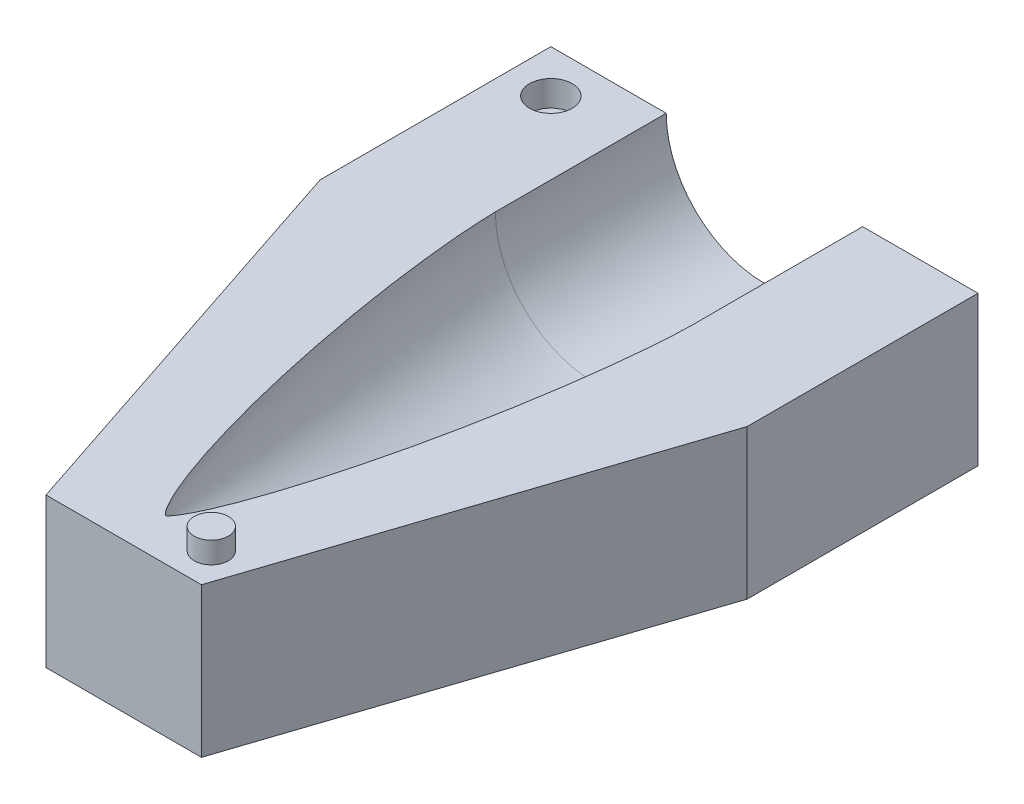
ISO-10303-21;
HEADER;
FILE_DESCRIPTION(('STEP AP214'),'2;1');
FILE_NAME('part.step','',(''),(''),'','','');
FILE_SCHEMA(('AUTOMOTIVE_DESIGN { 1 0 10303 214 1 1 1 1 }'));
ENDSEC;
DATA;
#1=APPLICATION_CONTEXT('core data for automotive mechanical design processes');
#2=APPLICATION_PROTOCOL_DEFINITION('international standard','automotive_design',2000,#1);
#3=PRODUCT_CONTEXT('',#1,'mechanical');
#4=PRODUCT('Part','Part','',(#3));
#5=PRODUCT_RELATED_PRODUCT_CATEGORY('part','',(#4));
#6=PRODUCT_DEFINITION_FORMATION('','',#4);
#7=PRODUCT_DEFINITION_CONTEXT('part definition',#1,'design');
#8=PRODUCT_DEFINITION('design','',#6,#7);
#9=PRODUCT_DEFINITION_SHAPE('','',#8);
#10=(LENGTH_UNIT() NAMED_UNIT(*) SI_UNIT(.MILLI.,.METRE.));
#11=(NAMED_UNIT(*) PLANE_ANGLE_UNIT() SI_UNIT($,.RADIAN.));
#12=(NAMED_UNIT(*) SI_UNIT($,.STERADIAN.) SOLID_ANGLE_UNIT());
#13=UNCERTAINTY_MEASURE_WITH_UNIT(LENGTH_MEASURE(1.E-05),#10,'distance_accuracy_value','');
#14=(GEOMETRIC_REPRESENTATION_CONTEXT(3) GLOBAL_UNCERTAINTY_ASSIGNED_CONTEXT((#13)) GLOBAL_UNIT_ASSIGNED_CONTEXT((#10,
#11,#12)) REPRESENTATION_CONTEXT('',''));
#15=CARTESIAN_POINT('',(0.,0.,0.));
#16=DIRECTION('',(0.,0.,1.));
#17=DIRECTION('',(1.,0.,0.));
#18=AXIS2_PLACEMENT_3D('',#15,#16,#17);
#19=CARTESIAN_POINT('',(0.,0.,0.));
#20=DIRECTION('',(0.,1.,0.));
#21=DIRECTION('',(0.,0.,1.));
#22=AXIS2_PLACEMENT_3D('',#19,#20,#21);
#23=PLANE('',#22);
#24=CARTESIAN_POINT('',(-40.,0.,-130.177152604319));
#25=DIRECTION('',(0.,1.,0.));
#26=DIRECTION('',(0.,0.,1.));
#27=AXIS2_PLACEMENT_3D('',#24,#25,#26);
#28=CIRCLE('',#27,5.);
#29=CARTESIAN_POINT('',(-40.,0.,-125.177152604319));
#30=VERTEX_POINT('',#29);
#31=EDGE_CURVE('E203',#30,#30,#28,.T.);
#32=ORIENTED_EDGE('',*,*,#31,.F.);
#33=EDGE_LOOP('',(#32));
#34=FACE_BOUND('',#33,.T.);
#35=CARTESIAN_POINT('',(12.5,0.,1.8228473956807));
#36=DIRECTION('',(0.,1.,0.));
#37=DIRECTION('',(0.,0.,1.));
#38=AXIS2_PLACEMENT_3D('',#35,#36,#37);
#39=CIRCLE('',#38,3.99999999999999);
#40=CARTESIAN_POINT('',(12.5,0.,5.82284739568069));
#41=VERTEX_POINT('',#40);
#42=EDGE_CURVE('E202',#41,#41,#39,.T.);
#43=ORIENTED_EDGE('',*,*,#42,.F.);
#44=EDGE_LOOP('',(#43));
#45=FACE_BOUND('',#44,.T.);
#46=DIRECTION('',(-0.31461271111549,0.,-0.949220123050792));
#47=VECTOR('',#46,1.);
#48=CARTESIAN_POINT('',(-50.,0.,-86.1379769190762));
#49=LINE('',#48,#47);
#50=CARTESIAN_POINT('',(-18.1944215410112,0.,9.8228473956807));
#51=VERTEX_POINT('',#50);
#52=CARTESIAN_POINT('',(-50.,0.,-86.1379769190762));
#53=VERTEX_POINT('',#52);
#54=EDGE_CURVE('E53',#51,#53,#49,.T.);
#55=ORIENTED_EDGE('',*,*,#54,.F.);
#56=DIRECTION('',(1.,0.,0.));
#57=VECTOR('',#56,1.);
#58=CARTESIAN_POINT('',(50.,0.,9.82284739568071));
#59=LINE('',#58,#57);
#60=CARTESIAN_POINT('',(18.1944215410112,0.,9.82284739568071));
#61=VERTEX_POINT('',#60);
#62=EDGE_CURVE('E221',#51,#61,#59,.T.);
#63=ORIENTED_EDGE('',*,*,#62,.T.);
#64=DIRECTION('',(-0.31461271111549,0.,0.949220123050792));
#65=VECTOR('',#64,1.);
#66=CARTESIAN_POINT('',(50.,0.,-86.1379769190762));
#67=LINE('',#66,#65);
#68=CARTESIAN_POINT('',(50.,0.,-86.1379769190762));
#69=VERTEX_POINT('',#68);
#70=EDGE_CURVE('E106',#69,#61,#67,.T.);
#71=ORIENTED_EDGE('',*,*,#70,.F.);
#72=DIRECTION('',(0.,0.,-1.));
#73=VECTOR('',#72,1.);
#74=CARTESIAN_POINT('',(50.,0.,0.));
#75=LINE('',#74,#73);
#76=CARTESIAN_POINT('',(50.,0.,-140.177152604319));
#77=VERTEX_POINT('',#76);
#78=EDGE_CURVE('E218',#69,#77,#75,.T.);
#79=ORIENTED_EDGE('',*,*,#78,.T.);
#80=DIRECTION('',(-1.,0.,0.));
#81=VECTOR('',#80,1.);
#82=CARTESIAN_POINT('',(50.,0.,-140.177152604319));
#83=LINE('',#82,#81);
#84=CARTESIAN_POINT('',(22.9913156668105,0.,-140.177152604319));
#85=VERTEX_POINT('',#84);
#86=EDGE_CURVE('E224',#77,#85,#83,.T.);
#87=ORIENTED_EDGE('',*,*,#86,.T.);
#88=DIRECTION('',(0.,0.,1.));
#89=VECTOR('',#88,1.);
#90=CARTESIAN_POINT('',(22.9913156668105,0.,0.));
#91=LINE('',#90,#89);
#92=CARTESIAN_POINT('',(22.9913156668105,0.,-100.177152604319));
#93=VERTEX_POINT('',#92);
#94=EDGE_CURVE('E231',#93,#85,#91,.F.);
#95=ORIENTED_EDGE('',*,*,#94,.F.);
#96=CARTESIAN_POINT('',(22.9913156668105,0.,-100.177152604319));
#97=CARTESIAN_POINT('',(22.9913156668105,0.,-99.6773830837032));
#98=CARTESIAN_POINT('',(22.9714099908985,0.,-98.6779967487854));
#99=CARTESIAN_POINT('',(22.875635683383,0.,-96.058091381564));
#100=CARTESIAN_POINT('',(22.6037020160242,0.,-91.8227807600398));
#101=CARTESIAN_POINT('',(22.1286848305687,0.,-86.4776261404894));
#102=CARTESIAN_POINT('',(21.3981607536077,0.,-80.0304974375297));
#103=CARTESIAN_POINT('',(20.5386098353281,0.,-73.5994887283923));
#104=CARTESIAN_POINT('',(19.563313868504,0.,-67.1850290563144));
#105=CARTESIAN_POINT('',(18.4805873670043,0.,-60.7878898986517));
#106=CARTESIAN_POINT('',(17.2939613531271,0.,-54.4091903934157));
#107=CARTESIAN_POINT('',(16.0041295859224,0.,-48.050573204807));
#108=CARTESIAN_POINT('',(14.608588480337,0.,-41.7142661554974));
#109=CARTESIAN_POINT('',(13.1014603152078,0.,-35.4035516128153));
#110=CARTESIAN_POINT('',(11.4726463716587,0.,-29.1230056500835));
#111=CARTESIAN_POINT('',(9.70512739419416,0.,-22.8799735817056));
#112=CARTESIAN_POINT('',(7.81425914639031,0.,-16.8230635383473));
#113=CARTESIAN_POINT('',(5.98538683150435,0.,-11.5994318892449));
#114=CARTESIAN_POINT('',(4.31706153991178,0.,-7.40332814922314));
#115=CARTESIAN_POINT('',(2.96045388006277,0.,-4.44576491835928));
#116=CARTESIAN_POINT('',(2.03469009013861,0.,-2.67850290129982));
#117=CARTESIAN_POINT('',(1.35492318038811,0.,-1.55273765823771));
#118=CARTESIAN_POINT('',(0.902060291211029,0.,-0.901337008533642));
#119=CARTESIAN_POINT('',(0.601235581178347,0.,-0.524430354454517));
#120=CARTESIAN_POINT('',(0.401983994044902,0.,-0.306591117086136));
#121=CARTESIAN_POINT('',(0.271568578547477,0.,-0.181890949137895));
#122=CARTESIAN_POINT('',(0.18355763089567,0.,-0.108056169269483));
#123=CARTESIAN_POINT('',(0.121023529313261,0.,-0.0618261369939828));
#124=CARTESIAN_POINT('',(0.0725878926251186,0.,-0.0309109385181754));
#125=CARTESIAN_POINT('',(0.0363511615834242,0.,-0.0111976924309942));
#126=CARTESIAN_POINT('',(0.0123794988745162,0.,-0.00300104938316236));
#127=CARTESIAN_POINT('',(0.,0.,0.));
#128=B_SPLINE_CURVE_WITH_KNOTS('',4,(#96,#97,#98,#99,#100,#101,#102,#103,#104,#105,#106,#107,
#108,#109,#110,#111,#112,#113,#114,#115,#116,#117,#118,#119,#120,#121,#122,#123,#124,#125,#126,
#127),.UNSPECIFIED.,.F.,.F.,(5,1,1,1,1,1,1,1,1,1,1,1,1,1,1,1,1,1,1,1,1,1,1,1,1,1,1,1,5),(0.,
0.0192882576807905,0.038576515361581,0.101176729872675,0.163776945029332,0.226377163001962,
0.28897737378094,0.351577593164917,0.41417780461237,0.476778019122959,0.539378235463863,
0.601978443197806,0.664578657112351,0.727178867221817,0.789779094894328,0.852379287962573,
0.909435495456412,0.940735609346367,0.963989150052229,0.977912976551439,0.986394042544016,
0.991459623657023,0.994588016567133,0.99651192245248,0.997780202195846,0.998418212786685,
0.999020025882964,0.999510012941482,1.),.UNSPECIFIED.);
#129=CARTESIAN_POINT('',(0.,0.,0.));
#130=VERTEX_POINT('',#129);
#131=EDGE_CURVE('E38',#130,#93,#128,.F.);
#132=ORIENTED_EDGE('',*,*,#131,.F.);
#133=CARTESIAN_POINT('',(-22.9913156668105,0.,-100.177152604319));
#134=CARTESIAN_POINT('',(-22.9913156668105,0.,-99.6773830837032));
#135=CARTESIAN_POINT('',(-22.9714099908985,0.,-98.6779967487854));
#136=CARTESIAN_POINT('',(-22.875635683383,0.,-96.058091381564));
#137=CARTESIAN_POINT('',(-22.6037020160242,0.,-91.8227807600398));
#138=CARTESIAN_POINT('',(-22.1286848305687,0.,-86.4776261404894));
#139=CARTESIAN_POINT('',(-21.3981607536077,0.,-80.0304974375297));
#140=CARTESIAN_POINT('',(-20.5386098353281,0.,-73.5994887283923));
#141=CARTESIAN_POINT('',(-19.563313868504,0.,-67.1850290563144));
#142=CARTESIAN_POINT('',(-18.4805873670043,0.,-60.7878898986517));
#143=CARTESIAN_POINT('',(-17.2939613531271,0.,-54.4091903934157));
#144=CARTESIAN_POINT('',(-16.0041295859224,0.,-48.050573204807));
#145=CARTESIAN_POINT('',(-14.608588480337,0.,-41.7142661554974));
#146=CARTESIAN_POINT('',(-13.1014603152078,0.,-35.4035516128153));
#147=CARTESIAN_POINT('',(-11.4726463716587,0.,-29.1230056500835));
#148=CARTESIAN_POINT('',(-9.70512739419416,0.,-22.8799735817056));
#149=CARTESIAN_POINT('',(-7.81425914639031,0.,-16.8230635383473));
#150=CARTESIAN_POINT('',(-5.98538683150435,0.,-11.5994318892449));
#151=CARTESIAN_POINT('',(-4.31706153991178,0.,-7.40332814922314));
#152=CARTESIAN_POINT('',(-2.96045388006277,0.,-4.44576491835928));
#153=CARTESIAN_POINT('',(-2.03469009013861,0.,-2.67850290129982));
#154=CARTESIAN_POINT('',(-1.35492318038811,0.,-1.55273765823771));
#155=CARTESIAN_POINT('',(-0.902060291211029,0.,-0.901337008533642));
#156=CARTESIAN_POINT('',(-0.601235581178347,0.,-0.524430354454517));
#157=CARTESIAN_POINT('',(-0.401983994044902,0.,-0.306591117086136));
#158=CARTESIAN_POINT('',(-0.271568578547477,0.,-0.181890949137895));
#159=CARTESIAN_POINT('',(-0.18355763089567,0.,-0.108056169269483));
#160=CARTESIAN_POINT('',(-0.121023529313261,0.,-0.0618261369939828));
#161=CARTESIAN_POINT('',(-0.0725878926251186,0.,-0.0309109385181754));
#162=CARTESIAN_POINT('',(-0.0363511615834242,0.,-0.0111976924309942));
#163=CARTESIAN_POINT('',(-0.0123794988745162,0.,-0.00300104938316236));
#164=CARTESIAN_POINT('',(0.,0.,0.));
#165=B_SPLINE_CURVE_WITH_KNOTS('',4,(#133,#134,#135,#136,#137,#138,#139,#140,#141,#142,#143,
#144,#145,#146,#147,#148,#149,#150,#151,#152,#153,#154,#155,#156,#157,#158,#159,#160,#161,#162,
#163,#164),.UNSPECIFIED.,.F.,.F.,(5,1,1,1,1,1,1,1,1,1,1,1,1,1,1,1,1,1,1,1,1,1,1,1,1,1,1,1,5),
(0.,0.0192882576807905,0.038576515361581,0.101176729872675,0.163776945029332,0.226377163001962,
0.28897737378094,0.351577593164917,0.41417780461237,0.476778019122959,0.539378235463863,
0.601978443197806,0.664578657112351,0.727178867221817,0.789779094894328,0.852379287962573,
0.909435495456412,0.940735609346367,0.963989150052229,0.977912976551439,0.986394042544016,
0.991459623657023,0.994588016567133,0.99651192245248,0.997780202195846,0.998418212786685,
0.999020025882964,0.999510012941482,1.),.UNSPECIFIED.);
#166=CARTESIAN_POINT('',(-22.9913156668105,0.,-100.177152604319));
#167=VERTEX_POINT('',#166);
#168=EDGE_CURVE('E131',#167,#130,#165,.T.);
#169=ORIENTED_EDGE('',*,*,#168,.F.);
#170=DIRECTION('',(0.,0.,1.));
#171=VECTOR('',#170,1.);
#172=CARTESIAN_POINT('',(-22.9913156668105,0.,0.));
#173=LINE('',#172,#171);
#174=CARTESIAN_POINT('',(-22.9913156668105,0.,-140.177152604319));
#175=VERTEX_POINT('',#174);
#176=EDGE_CURVE('E228',#175,#167,#173,.T.);
#177=ORIENTED_EDGE('',*,*,#176,.F.);
#178=CARTESIAN_POINT('',(-50.,0.,-140.177152604319));
#179=VERTEX_POINT('',#178);
#180=EDGE_CURVE('E148',#175,#179,#83,.T.);
#181=ORIENTED_EDGE('',*,*,#180,.T.);
#182=DIRECTION('',(0.,0.,-1.));
#183=VECTOR('',#182,1.);
#184=CARTESIAN_POINT('',(-50.,0.,0.));
#185=LINE('',#184,#183);
#186=EDGE_CURVE('E223',#53,#179,#185,.T.);
#187=ORIENTED_EDGE('',*,*,#186,.F.);
#188=EDGE_LOOP('',(#55,#63,#71,#79,#87,#95,#132,#169,#177,#181,#187));
#189=FACE_BOUND('',#188,.T.);
#190=ADVANCED_FACE('F35',(#34,#45,#189),#23,.T.);
#191=CARTESIAN_POINT('',(50.,-35.,-140.177152604319));
#192=DIRECTION('',(0.,1.,0.));
#193=DIRECTION('',(0.,0.,1.));
#194=AXIS2_PLACEMENT_3D('',#191,#192,#193);
#195=PLANE('',#194);
#196=DIRECTION('',(-1.,0.,0.));
#197=VECTOR('',#196,1.);
#198=CARTESIAN_POINT('',(50.,-35.,9.82284739568071));
#199=LINE('',#198,#197);
#200=CARTESIAN_POINT('',(18.1944215410112,-35.,9.82284739568071));
#201=VERTEX_POINT('',#200);
#202=CARTESIAN_POINT('',(-18.1944215410112,-35.,9.8228473956807));
#203=VERTEX_POINT('',#202);
#204=EDGE_CURVE('E119',#201,#203,#199,.T.);
#205=ORIENTED_EDGE('',*,*,#204,.T.);
#206=DIRECTION('',(-0.31461271111549,0.,-0.949220123050792));
#207=VECTOR('',#206,1.);
#208=CARTESIAN_POINT('',(-50.,-35.,-86.1379769190762));
#209=LINE('',#208,#207);
#210=CARTESIAN_POINT('',(-50.,-35.,-86.1379769190762));
#211=VERTEX_POINT('',#210);
#212=EDGE_CURVE('E122',#203,#211,#209,.T.);
#213=ORIENTED_EDGE('',*,*,#212,.T.);
#214=DIRECTION('',(0.,0.,-1.));
#215=VECTOR('',#214,1.);
#216=CARTESIAN_POINT('',(-50.,-35.,-140.177152604319));
#217=LINE('',#216,#215);
#218=CARTESIAN_POINT('',(-50.,-35.,-140.177152604319));
#219=VERTEX_POINT('',#218);
#220=EDGE_CURVE('E134',#211,#219,#217,.T.);
#221=ORIENTED_EDGE('',*,*,#220,.T.);
#222=DIRECTION('',(-1.,0.,0.));
#223=VECTOR('',#222,1.);
#224=CARTESIAN_POINT('',(50.,-35.,-140.177152604319));
#225=LINE('',#224,#223);
#226=CARTESIAN_POINT('',(50.,-35.,-140.177152604319));
#227=VERTEX_POINT('',#226);
#228=EDGE_CURVE('E126',#227,#219,#225,.T.);
#229=ORIENTED_EDGE('',*,*,#228,.F.);
#230=DIRECTION('',(0.,0.,-1.));
#231=VECTOR('',#230,1.);
#232=CARTESIAN_POINT('',(50.,-35.,-140.177152604319));
#233=LINE('',#232,#231);
#234=CARTESIAN_POINT('',(50.,-35.,-86.1379769190762));
#235=VERTEX_POINT('',#234);
#236=EDGE_CURVE('E121',#235,#227,#233,.T.);
#237=ORIENTED_EDGE('',*,*,#236,.F.);
#238=DIRECTION('',(-0.31461271111549,0.,0.949220123050792));
#239=VECTOR('',#238,1.);
#240=CARTESIAN_POINT('',(50.,-35.,-86.1379769190762));
#241=LINE('',#240,#239);
#242=EDGE_CURVE('E61',#235,#201,#241,.T.);
#243=ORIENTED_EDGE('',*,*,#242,.T.);
#244=EDGE_LOOP('',(#205,#213,#221,#229,#237,#243));
#245=FACE_BOUND('',#244,.T.);
#246=ADVANCED_FACE('F117',(#245),#195,.F.);
#247=CARTESIAN_POINT('',(50.,35.,-140.177152604319));
#248=DIRECTION('',(0.,0.,1.));
#249=DIRECTION('',(1.,0.,0.));
#250=AXIS2_PLACEMENT_3D('',#247,#248,#249);
#251=PLANE('',#250);
#252=ORIENTED_EDGE('',*,*,#86,.F.);
#253=DIRECTION('',(0.,1.,0.));
#254=VECTOR('',#253,1.);
#255=CARTESIAN_POINT('',(50.,35.,-140.177152604319));
#256=LINE('',#255,#254);
#257=EDGE_CURVE('E137',#227,#77,#256,.T.);
#258=ORIENTED_EDGE('',*,*,#257,.F.);
#259=ORIENTED_EDGE('',*,*,#228,.T.);
#260=DIRECTION('',(0.,1.,0.));
#261=VECTOR('',#260,1.);
#262=CARTESIAN_POINT('',(-50.,35.,-140.177152604319));
#263=LINE('',#262,#261);
#264=EDGE_CURVE('E136',#219,#179,#263,.T.);
#265=ORIENTED_EDGE('',*,*,#264,.T.);
#266=ORIENTED_EDGE('',*,*,#180,.F.);
#267=CARTESIAN_POINT('',(0.,0.,-140.177152604319));
#268=DIRECTION('',(0.,0.,1.));
#269=DIRECTION('',(1.,0.,0.));
#270=AXIS2_PLACEMENT_3D('',#267,#268,#269);
#271=CIRCLE('',#270,22.9913156668105);
#272=EDGE_CURVE('E45',#175,#85,#271,.T.);
#273=ORIENTED_EDGE('',*,*,#272,.T.);
#274=EDGE_LOOP('',(#252,#258,#259,#265,#266,#273));
#275=FACE_BOUND('',#274,.T.);
#276=ADVANCED_FACE('F160',(#275),#251,.F.);
#277=CARTESIAN_POINT('',(0.,0.,0.));
#278=DIRECTION('',(0.,0.,1.));
#279=DIRECTION('',(1.,0.,0.));
#280=AXIS2_PLACEMENT_3D('',#277,#278,#279);
#281=CYLINDRICAL_SURFACE('',#280,22.9913156668105);
#282=ORIENTED_EDGE('',*,*,#272,.F.);
#283=ORIENTED_EDGE('',*,*,#176,.T.);
#284=CARTESIAN_POINT('',(0.,0.,-100.177152604319));
#285=DIRECTION('',(0.,0.,1.));
#286=DIRECTION('',(1.,0.,0.));
#287=AXIS2_PLACEMENT_3D('',#284,#285,#286);
#288=CIRCLE('',#287,22.9913156668105);
#289=EDGE_CURVE('E12',#167,#93,#288,.T.);
#290=ORIENTED_EDGE('',*,*,#289,.T.);
#291=ORIENTED_EDGE('',*,*,#94,.T.);
#292=EDGE_LOOP('',(#282,#283,#290,#291));
#293=FACE_BOUND('',#292,.T.);
#294=ADVANCED_FACE('F156',(#293),#281,.F.);
#295=CARTESIAN_POINT('',(0.,22.9913156668105,-100.177152604319));
#296=CARTESIAN_POINT('',(0.,22.9913156668105,-99.6773830837032));
#297=CARTESIAN_POINT('',(0.,22.9714099908985,-98.6779967487854));
#298=CARTESIAN_POINT('',(0.,22.875635683383,-96.058091381564));
#299=CARTESIAN_POINT('',(0.,22.6037020160242,-91.8227807600398));
#300=CARTESIAN_POINT('',(0.,22.1286848305687,-86.4776261404894));
#301=CARTESIAN_POINT('',(0.,21.3981607536077,-80.0304974375297));
#302=CARTESIAN_POINT('',(0.,20.5386098353281,-73.5994887283923));
#303=CARTESIAN_POINT('',(0.,19.563313868504,-67.1850290563144));
#304=CARTESIAN_POINT('',(0.,18.4805873670043,-60.7878898986517));
#305=CARTESIAN_POINT('',(0.,17.2939613531271,-54.4091903934157));
#306=CARTESIAN_POINT('',(0.,16.0041295859224,-48.050573204807));
#307=CARTESIAN_POINT('',(0.,14.608588480337,-41.7142661554974));
#308=CARTESIAN_POINT('',(0.,13.1014603152078,-35.4035516128153));
#309=CARTESIAN_POINT('',(0.,11.4726463716587,-29.1230056500835));
#310=CARTESIAN_POINT('',(0.,9.70512739419416,-22.8799735817056));
#311=CARTESIAN_POINT('',(0.,7.81425914639031,-16.8230635383473));
#312=CARTESIAN_POINT('',(0.,5.98538683150435,-11.5994318892449));
#313=CARTESIAN_POINT('',(0.,4.31706153991178,-7.40332814922314));
#314=CARTESIAN_POINT('',(0.,2.96045388006277,-4.44576491835928));
#315=CARTESIAN_POINT('',(0.,2.03469009013861,-2.67850290129982));
#316=CARTESIAN_POINT('',(0.,1.35492318038811,-1.55273765823771));
#317=CARTESIAN_POINT('',(0.,0.902060291211029,-0.901337008533642));
#318=CARTESIAN_POINT('',(0.,0.601235581178347,-0.524430354454517));
#319=CARTESIAN_POINT('',(0.,0.401983994044902,-0.306591117086136));
#320=CARTESIAN_POINT('',(0.,0.271568578547477,-0.181890949137895));
#321=CARTESIAN_POINT('',(0.,0.18355763089567,-0.108056169269483));
#322=CARTESIAN_POINT('',(0.,0.121023529313261,-0.0618261369939828));
#323=CARTESIAN_POINT('',(0.,0.0725878926251186,-0.0309109385181754));
#324=CARTESIAN_POINT('',(0.,0.0363511615834242,-0.0111976924309942));
#325=CARTESIAN_POINT('',(0.,0.0123794988745162,-0.00300104938316236));
#326=CARTESIAN_POINT('',(0.,0.,0.));
#327=B_SPLINE_CURVE_WITH_KNOTS('',4,(#295,#296,#297,#298,#299,#300,#301,#302,#303,#304,#305,
#306,#307,#308,#309,#310,#311,#312,#313,#314,#315,#316,#317,#318,#319,#320,#321,#322,#323,#324,
#325,#326),.UNSPECIFIED.,.F.,.F.,(5,1,1,1,1,1,1,1,1,1,1,1,1,1,1,1,1,1,1,1,1,1,1,1,1,1,1,1,5),
(0.,0.0192882576807905,0.038576515361581,0.101176729872675,0.163776945029332,0.226377163001962,
0.28897737378094,0.351577593164917,0.41417780461237,0.476778019122959,0.539378235463863,
0.601978443197806,0.664578657112351,0.727178867221817,0.789779094894328,0.852379287962573,
0.909435495456412,0.940735609346367,0.963989150052229,0.977912976551439,0.986394042544016,
0.991459623657023,0.994588016567133,0.99651192245248,0.997780202195846,0.998418212786685,
0.999020025882964,0.999510012941482,1.),.UNSPECIFIED.);
#328=CARTESIAN_POINT('',(0.,0.,0.));
#329=DIRECTION('',(0.,0.,1.));
#330=AXIS1_PLACEMENT('',#328,#329);
#331=SURFACE_OF_REVOLUTION('',#327,#330);
#332=ORIENTED_EDGE('',*,*,#289,.F.);
#333=ORIENTED_EDGE('',*,*,#168,.T.);
#334=ORIENTED_EDGE('',*,*,#131,.T.);
#335=EDGE_LOOP('',(#332,#333,#334));
#336=FACE_BOUND('',#335,.T.);
#337=ADVANCED_FACE('F153',(#336),#331,.F.);
#338=CARTESIAN_POINT('',(50.,35.,9.82284739568071));
#339=DIRECTION('',(0.,0.,-1.));
#340=DIRECTION('',(-1.,0.,0.));
#341=AXIS2_PLACEMENT_3D('',#338,#339,#340);
#342=PLANE('',#341);
#343=ORIENTED_EDGE('',*,*,#62,.F.);
#344=DIRECTION('',(0.,1.,0.));
#345=VECTOR('',#344,1.);
#346=CARTESIAN_POINT('',(-18.1944215410112,-35.,9.8228473956807));
#347=LINE('',#346,#345);
#348=EDGE_CURVE('E111',#203,#51,#347,.T.);
#349=ORIENTED_EDGE('',*,*,#348,.F.);
#350=ORIENTED_EDGE('',*,*,#204,.F.);
#351=DIRECTION('',(0.,1.,0.));
#352=VECTOR('',#351,1.);
#353=CARTESIAN_POINT('',(18.1944215410112,-35.,9.82284739568071));
#354=LINE('',#353,#352);
#355=EDGE_CURVE('E103',#201,#61,#354,.T.);
#356=ORIENTED_EDGE('',*,*,#355,.T.);
#357=EDGE_LOOP('',(#343,#349,#350,#356));
#358=FACE_BOUND('',#357,.T.);
#359=ADVANCED_FACE('F125',(#358),#342,.F.);
#360=CARTESIAN_POINT('',(-50.,0.,0.));
#361=DIRECTION('',(-1.,0.,0.));
#362=DIRECTION('',(0.,0.,1.));
#363=AXIS2_PLACEMENT_3D('',#360,#361,#362);
#364=PLANE('',#363);
#365=DIRECTION('',(0.,1.,0.));
#366=VECTOR('',#365,1.);
#367=CARTESIAN_POINT('',(-50.,-35.,-86.1379769190762));
#368=LINE('',#367,#366);
#369=EDGE_CURVE('E216',#211,#53,#368,.T.);
#370=ORIENTED_EDGE('',*,*,#369,.T.);
#371=ORIENTED_EDGE('',*,*,#186,.T.);
#372=ORIENTED_EDGE('',*,*,#264,.F.);
#373=ORIENTED_EDGE('',*,*,#220,.F.);
#374=EDGE_LOOP('',(#370,#371,#372,#373));
#375=FACE_BOUND('',#374,.T.);
#376=ADVANCED_FACE('F162',(#375),#364,.T.);
#377=CARTESIAN_POINT('',(50.,0.,0.));
#378=DIRECTION('',(-1.,0.,0.));
#379=DIRECTION('',(0.,0.,1.));
#380=AXIS2_PLACEMENT_3D('',#377,#378,#379);
#381=PLANE('',#380);
#382=ORIENTED_EDGE('',*,*,#78,.F.);
#383=DIRECTION('',(0.,1.,0.));
#384=VECTOR('',#383,1.);
#385=CARTESIAN_POINT('',(50.,-35.,-86.1379769190762));
#386=LINE('',#385,#384);
#387=EDGE_CURVE('E112',#235,#69,#386,.T.);
#388=ORIENTED_EDGE('',*,*,#387,.F.);
#389=ORIENTED_EDGE('',*,*,#236,.T.);
#390=ORIENTED_EDGE('',*,*,#257,.T.);
#391=EDGE_LOOP('',(#382,#388,#389,#390));
#392=FACE_BOUND('',#391,.T.);
#393=ADVANCED_FACE('F165',(#392),#381,.F.);
#394=CARTESIAN_POINT('',(50.,-35.,-86.1379769190762));
#395=DIRECTION('',(-0.949220123050792,0.,-0.31461271111549));
#396=DIRECTION('',(-0.31461271111549,0.,0.949220123050792));
#397=AXIS2_PLACEMENT_3D('',#394,#395,#396);
#398=PLANE('',#397);
#399=ORIENTED_EDGE('',*,*,#70,.T.);
#400=ORIENTED_EDGE('',*,*,#355,.F.);
#401=ORIENTED_EDGE('',*,*,#242,.F.);
#402=ORIENTED_EDGE('',*,*,#387,.T.);
#403=EDGE_LOOP('',(#399,#400,#401,#402));
#404=FACE_BOUND('',#403,.T.);
#405=ADVANCED_FACE('F104',(#404),#398,.F.);
#406=CARTESIAN_POINT('',(-50.,-35.,-86.1379769190762));
#407=DIRECTION('',(0.949220123050792,0.,-0.31461271111549));
#408=DIRECTION('',(-0.31461271111549,0.,-0.949220123050792));
#409=AXIS2_PLACEMENT_3D('',#406,#407,#408);
#410=PLANE('',#409);
#411=ORIENTED_EDGE('',*,*,#54,.T.);
#412=ORIENTED_EDGE('',*,*,#369,.F.);
#413=ORIENTED_EDGE('',*,*,#212,.F.);
#414=ORIENTED_EDGE('',*,*,#348,.T.);
#415=EDGE_LOOP('',(#411,#412,#413,#414));
#416=FACE_BOUND('',#415,.T.);
#417=ADVANCED_FACE('F179',(#416),#410,.F.);
#418=CARTESIAN_POINT('',(12.5,5.,1.8228473956807));
#419=DIRECTION('',(0.,-1.,0.));
#420=DIRECTION('',(0.,0.,-1.));
#421=AXIS2_PLACEMENT_3D('',#418,#419,#420);
#422=CYLINDRICAL_SURFACE('',#421,3.99999999999999);
#423=CARTESIAN_POINT('',(12.5,5.,1.8228473956807));
#424=DIRECTION('',(0.,1.,0.));
#425=DIRECTION('',(0.,0.,1.));
#426=AXIS2_PLACEMENT_3D('',#423,#424,#425);
#427=CIRCLE('',#426,3.99999999999999);
#428=CARTESIAN_POINT('',(12.5,5.,5.82284739568069));
#429=VERTEX_POINT('',#428);
#430=EDGE_CURVE('E206',#429,#429,#427,.T.);
#431=ORIENTED_EDGE('',*,*,#430,.F.);
#432=EDGE_LOOP('',(#431));
#433=FACE_BOUND('',#432,.T.);
#434=ORIENTED_EDGE('',*,*,#42,.T.);
#435=EDGE_LOOP('',(#434));
#436=FACE_BOUND('',#435,.T.);
#437=ADVANCED_FACE('F182',(#433,#436),#422,.T.);
#438=CARTESIAN_POINT('',(12.5,5.,1.8228473956807));
#439=DIRECTION('',(0.,1.,0.));
#440=DIRECTION('',(0.,0.,1.));
#441=AXIS2_PLACEMENT_3D('',#438,#439,#440);
#442=PLANE('',#441);
#443=ORIENTED_EDGE('',*,*,#430,.T.);
#444=EDGE_LOOP('',(#443));
#445=FACE_BOUND('',#444,.T.);
#446=ADVANCED_FACE('F185',(#445),#442,.T.);
#447=CARTESIAN_POINT('',(-40.,-6.,-130.177152604319));
#448=DIRECTION('',(0.,1.,0.));
#449=DIRECTION('',(0.,0.,1.));
#450=AXIS2_PLACEMENT_3D('',#447,#448,#449);
#451=CYLINDRICAL_SURFACE('',#450,5.);
#452=CARTESIAN_POINT('',(-40.,-6.,-130.177152604319));
#453=DIRECTION('',(0.,1.,0.));
#454=DIRECTION('',(0.,0.,1.));
#455=AXIS2_PLACEMENT_3D('',#452,#453,#454);
#456=CIRCLE('',#455,5.);
#457=CARTESIAN_POINT('',(-40.,-6.,-125.177152604319));
#458=VERTEX_POINT('',#457);
#459=EDGE_CURVE('E201',#458,#458,#456,.T.);
#460=ORIENTED_EDGE('',*,*,#459,.F.);
#461=EDGE_LOOP('',(#460));
#462=FACE_BOUND('',#461,.T.);
#463=ORIENTED_EDGE('',*,*,#31,.T.);
#464=EDGE_LOOP('',(#463));
#465=FACE_BOUND('',#464,.T.);
#466=ADVANCED_FACE('F189',(#462,#465),#451,.F.);
#467=CARTESIAN_POINT('',(-40.,-6.,-130.177152604319));
#468=DIRECTION('',(0.,1.,0.));
#469=DIRECTION('',(0.,0.,1.));
#470=AXIS2_PLACEMENT_3D('',#467,#468,#469);
#471=PLANE('',#470);
#472=ORIENTED_EDGE('',*,*,#459,.T.);
#473=EDGE_LOOP('',(#472));
#474=FACE_BOUND('',#473,.T.);
#475=ADVANCED_FACE('F193',(#474),#471,.T.);
#476=CLOSED_SHELL('',(#190,#246,#276,#294,#337,#359,#376,#393,#405,#417,#437,#446,#466,#475));
#477=MANIFOLD_SOLID_BREP('B2',#476);
#478=ADVANCED_BREP_SHAPE_REPRESENTATION('',(#18,#477),#14);
#479=SHAPE_DEFINITION_REPRESENTATION(#9,#478);
ENDSEC;
END-ISO-10303-21;
